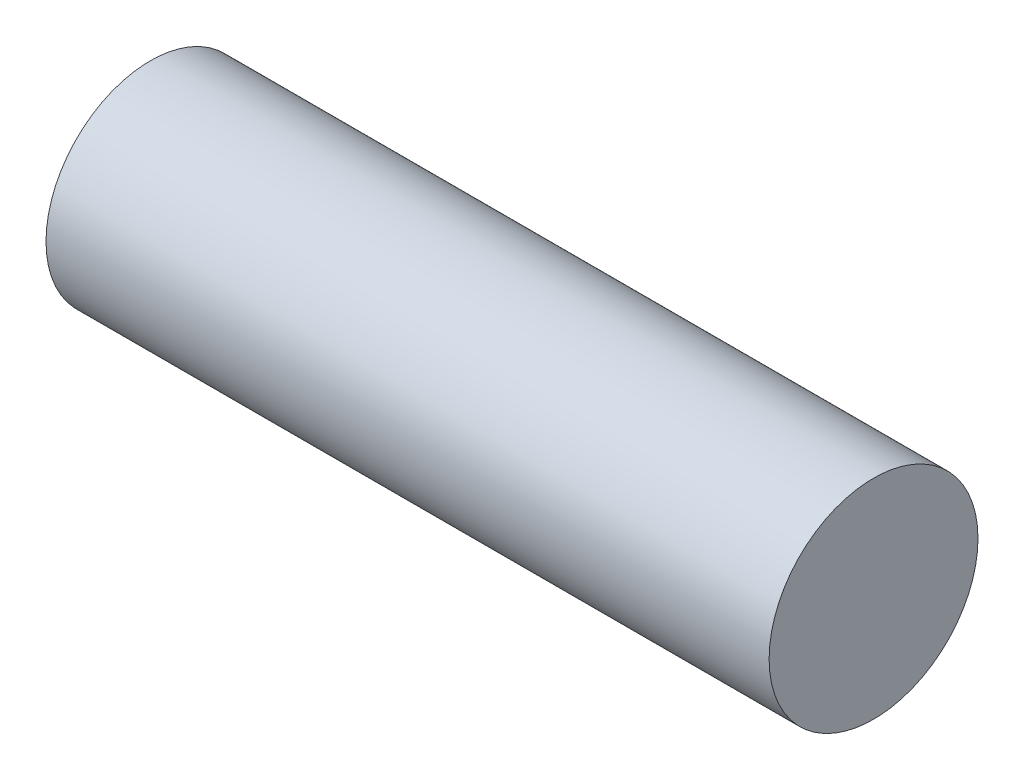
ISO-10303-21;
HEADER;
FILE_DESCRIPTION(('STEP AP214'),'2;1');
FILE_NAME('part.step','',(''),(''),'','','');
FILE_SCHEMA(('AUTOMOTIVE_DESIGN { 1 0 10303 214 1 1 1 1 }'));
ENDSEC;
DATA;
#1=APPLICATION_CONTEXT('core data for automotive mechanical design processes');
#2=APPLICATION_PROTOCOL_DEFINITION('international standard','automotive_design',2000,#1);
#3=PRODUCT_CONTEXT('',#1,'mechanical');
#4=PRODUCT('Part','Part','',(#3));
#5=PRODUCT_RELATED_PRODUCT_CATEGORY('part','',(#4));
#6=PRODUCT_DEFINITION_FORMATION('','',#4);
#7=PRODUCT_DEFINITION_CONTEXT('part definition',#1,'design');
#8=PRODUCT_DEFINITION('design','',#6,#7);
#9=PRODUCT_DEFINITION_SHAPE('','',#8);
#10=(LENGTH_UNIT() NAMED_UNIT(*) SI_UNIT(.MILLI.,.METRE.));
#11=(NAMED_UNIT(*) PLANE_ANGLE_UNIT() SI_UNIT($,.RADIAN.));
#12=(NAMED_UNIT(*) SI_UNIT($,.STERADIAN.) SOLID_ANGLE_UNIT());
#13=UNCERTAINTY_MEASURE_WITH_UNIT(LENGTH_MEASURE(1.E-05),#10,'distance_accuracy_value','');
#14=(GEOMETRIC_REPRESENTATION_CONTEXT(3) GLOBAL_UNCERTAINTY_ASSIGNED_CONTEXT((#13)) GLOBAL_UNIT_ASSIGNED_CONTEXT((#10,
#11,#12)) REPRESENTATION_CONTEXT('',''));
#15=CARTESIAN_POINT('',(0.,0.,0.));
#16=DIRECTION('',(0.,0.,1.));
#17=DIRECTION('',(1.,0.,0.));
#18=AXIS2_PLACEMENT_3D('',#15,#16,#17);
#19=CARTESIAN_POINT('',(9.,0.,0.));
#20=DIRECTION('',(-1.,0.,0.));
#21=DIRECTION('',(0.,0.,1.));
#22=AXIS2_PLACEMENT_3D('',#19,#20,#21);
#23=CYLINDRICAL_SURFACE('',#22,2.6);
#24=CARTESIAN_POINT('',(9.,0.,0.));
#25=DIRECTION('',(1.,0.,0.));
#26=DIRECTION('',(0.,0.,-1.));
#27=AXIS2_PLACEMENT_3D('',#24,#25,#26);
#28=CIRCLE('',#27,2.6);
#29=CARTESIAN_POINT('',(9.,0.,-2.6));
#30=VERTEX_POINT('',#29);
#31=EDGE_CURVE('E10',#30,#30,#28,.T.);
#32=ORIENTED_EDGE('',*,*,#31,.F.);
#33=EDGE_LOOP('',(#32));
#34=FACE_BOUND('',#33,.T.);
#35=CARTESIAN_POINT('',(-9.,0.,0.));
#36=DIRECTION('',(1.,0.,0.));
#37=DIRECTION('',(0.,0.,-1.));
#38=AXIS2_PLACEMENT_3D('',#35,#36,#37);
#39=CIRCLE('',#38,2.6);
#40=CARTESIAN_POINT('',(-9.,0.,-2.6));
#41=VERTEX_POINT('',#40);
#42=EDGE_CURVE('E34',#41,#41,#39,.T.);
#43=ORIENTED_EDGE('',*,*,#42,.T.);
#44=EDGE_LOOP('',(#43));
#45=FACE_BOUND('',#44,.T.);
#46=ADVANCED_FACE('F31',(#34,#45),#23,.T.);
#47=CARTESIAN_POINT('',(9.,0.,0.));
#48=DIRECTION('',(1.,0.,0.));
#49=DIRECTION('',(0.,0.,-1.));
#50=AXIS2_PLACEMENT_3D('',#47,#48,#49);
#51=PLANE('',#50);
#52=ORIENTED_EDGE('',*,*,#31,.T.);
#53=EDGE_LOOP('',(#52));
#54=FACE_BOUND('',#53,.T.);
#55=ADVANCED_FACE('F46',(#54),#51,.T.);
#56=CARTESIAN_POINT('',(-9.,0.,0.));
#57=DIRECTION('',(1.,0.,0.));
#58=DIRECTION('',(0.,0.,-1.));
#59=AXIS2_PLACEMENT_3D('',#56,#57,#58);
#60=PLANE('',#59);
#61=ORIENTED_EDGE('',*,*,#42,.F.);
#62=EDGE_LOOP('',(#61));
#63=FACE_BOUND('',#62,.T.);
#64=ADVANCED_FACE('F44',(#63),#60,.F.);
#65=CLOSED_SHELL('',(#46,#55,#64));
#66=MANIFOLD_SOLID_BREP('B2',#65);
#67=ADVANCED_BREP_SHAPE_REPRESENTATION('',(#18,#66),#14);
#68=SHAPE_DEFINITION_REPRESENTATION(#9,#67);
ENDSEC;
END-ISO-10303-21;
